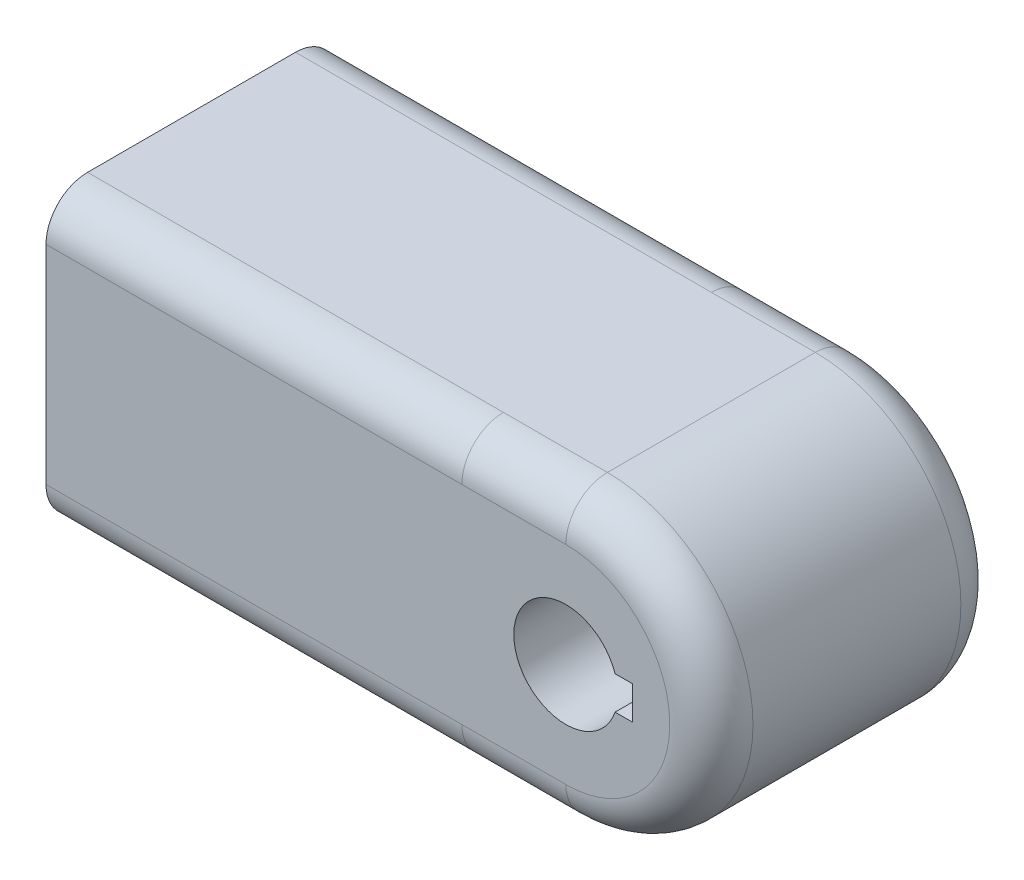
ISO-10303-21;
HEADER;
FILE_DESCRIPTION(('STEP AP214'),'2;1');
FILE_NAME('part.step','',(''),(''),'','','');
FILE_SCHEMA(('AUTOMOTIVE_DESIGN { 1 0 10303 214 1 1 1 1 }'));
ENDSEC;
DATA;
#1=APPLICATION_CONTEXT('core data for automotive mechanical design processes');
#2=APPLICATION_PROTOCOL_DEFINITION('international standard','automotive_design',2000,#1);
#3=PRODUCT_CONTEXT('',#1,'mechanical');
#4=PRODUCT('Part','Part','',(#3));
#5=PRODUCT_RELATED_PRODUCT_CATEGORY('part','',(#4));
#6=PRODUCT_DEFINITION_FORMATION('','',#4);
#7=PRODUCT_DEFINITION_CONTEXT('part definition',#1,'design');
#8=PRODUCT_DEFINITION('design','',#6,#7);
#9=PRODUCT_DEFINITION_SHAPE('','',#8);
#10=(LENGTH_UNIT() NAMED_UNIT(*) SI_UNIT(.MILLI.,.METRE.));
#11=(NAMED_UNIT(*) PLANE_ANGLE_UNIT() SI_UNIT($,.RADIAN.));
#12=(NAMED_UNIT(*) SI_UNIT($,.STERADIAN.) SOLID_ANGLE_UNIT());
#13=UNCERTAINTY_MEASURE_WITH_UNIT(LENGTH_MEASURE(1.E-05),#10,'distance_accuracy_value','');
#14=(GEOMETRIC_REPRESENTATION_CONTEXT(3) GLOBAL_UNCERTAINTY_ASSIGNED_CONTEXT((#13)) GLOBAL_UNIT_ASSIGNED_CONTEXT((#10,
#11,#12)) REPRESENTATION_CONTEXT('',''));
#15=CARTESIAN_POINT('',(0.,0.,0.));
#16=DIRECTION('',(0.,0.,1.));
#17=DIRECTION('',(1.,0.,0.));
#18=AXIS2_PLACEMENT_3D('',#15,#16,#17);
#19=CARTESIAN_POINT('',(125.,0.,35.));
#20=DIRECTION('',(0.,0.,1.));
#21=DIRECTION('',(1.,0.,0.));
#22=AXIS2_PLACEMENT_3D('',#19,#20,#21);
#23=CYLINDRICAL_SURFACE('',#22,35.);
#24=DIRECTION('',(0.,0.,1.));
#25=VECTOR('',#24,1.);
#26=CARTESIAN_POINT('',(125.,35.,24.9999999999999));
#27=LINE('',#26,#25);
#28=CARTESIAN_POINT('',(125.,35.,25.));
#29=VERTEX_POINT('',#28);
#30=CARTESIAN_POINT('',(125.,35.,-25.));
#31=VERTEX_POINT('',#30);
#32=EDGE_CURVE('E413',#29,#31,#27,.F.);
#33=ORIENTED_EDGE('',*,*,#32,.F.);
#34=CARTESIAN_POINT('',(125.,0.,25.));
#35=DIRECTION('',(0.,0.,-1.));
#36=DIRECTION('',(-1.,0.,0.));
#37=AXIS2_PLACEMENT_3D('',#34,#35,#36);
#38=CIRCLE('',#37,35.);
#39=CARTESIAN_POINT('',(125.,-35.,25.));
#40=VERTEX_POINT('',#39);
#41=EDGE_CURVE('E440',#29,#40,#38,.T.);
#42=ORIENTED_EDGE('',*,*,#41,.T.);
#43=DIRECTION('',(0.,0.,1.));
#44=VECTOR('',#43,1.);
#45=CARTESIAN_POINT('',(125.,-35.,24.9999999999999));
#46=LINE('',#45,#44);
#47=CARTESIAN_POINT('',(125.,-35.,-25.));
#48=VERTEX_POINT('',#47);
#49=EDGE_CURVE('E417',#48,#40,#46,.T.);
#50=ORIENTED_EDGE('',*,*,#49,.F.);
#51=CARTESIAN_POINT('',(125.,0.,-25.));
#52=DIRECTION('',(0.,0.,1.));
#53=DIRECTION('',(1.,0.,0.));
#54=AXIS2_PLACEMENT_3D('',#51,#52,#53);
#55=CIRCLE('',#54,35.);
#56=EDGE_CURVE('E437',#48,#31,#55,.T.);
#57=ORIENTED_EDGE('',*,*,#56,.T.);
#58=EDGE_LOOP('',(#33,#42,#50,#57));
#59=FACE_BOUND('',#58,.T.);
#60=ADVANCED_FACE('F41',(#59),#23,.T.);
#61=CARTESIAN_POINT('',(0.,-25.,-25.));
#62=DIRECTION('',(1.,0.,0.));
#63=DIRECTION('',(0.,0.,-1.));
#64=AXIS2_PLACEMENT_3D('',#61,#62,#63);
#65=PLANE('',#64);
#66=CARTESIAN_POINT('',(0.,-25.,-25.));
#67=DIRECTION('',(1.,0.,0.));
#68=DIRECTION('',(0.,0.,-1.));
#69=AXIS2_PLACEMENT_3D('',#66,#67,#68);
#70=CIRCLE('',#69,10.);
#71=CARTESIAN_POINT('',(0.,-35.,-24.9999999999999));
#72=VERTEX_POINT('',#71);
#73=CARTESIAN_POINT('',(0.,-24.9999999999999,-35.));
#74=VERTEX_POINT('',#73);
#75=EDGE_CURVE('E342',#72,#74,#70,.T.);
#76=ORIENTED_EDGE('',*,*,#75,.F.);
#77=DIRECTION('',(0.,0.,-1.));
#78=VECTOR('',#77,1.);
#79=CARTESIAN_POINT('',(0.,-35.,24.9999999999999));
#80=LINE('',#79,#78);
#81=CARTESIAN_POINT('',(0.,-35.,24.9999999999999));
#82=VERTEX_POINT('',#81);
#83=EDGE_CURVE('E347',#82,#72,#80,.T.);
#84=ORIENTED_EDGE('',*,*,#83,.F.);
#85=CARTESIAN_POINT('',(0.,-25.,25.));
#86=DIRECTION('',(1.,0.,0.));
#87=DIRECTION('',(0.,0.,1.));
#88=AXIS2_PLACEMENT_3D('',#85,#86,#87);
#89=CIRCLE('',#88,10.);
#90=CARTESIAN_POINT('',(0.,-25.,35.));
#91=VERTEX_POINT('',#90);
#92=EDGE_CURVE('E377',#91,#82,#89,.T.);
#93=ORIENTED_EDGE('',*,*,#92,.F.);
#94=DIRECTION('',(0.,-1.,0.));
#95=VECTOR('',#94,1.);
#96=CARTESIAN_POINT('',(0.,-24.9999999999999,35.));
#97=LINE('',#96,#95);
#98=CARTESIAN_POINT('',(0.,24.9999999999999,35.));
#99=VERTEX_POINT('',#98);
#100=EDGE_CURVE('E374',#99,#91,#97,.T.);
#101=ORIENTED_EDGE('',*,*,#100,.F.);
#102=CARTESIAN_POINT('',(0.,25.,25.));
#103=DIRECTION('',(1.,0.,0.));
#104=DIRECTION('',(0.,0.,1.));
#105=AXIS2_PLACEMENT_3D('',#102,#103,#104);
#106=CIRCLE('',#105,10.);
#107=CARTESIAN_POINT('',(0.,35.,24.9999999999999));
#108=VERTEX_POINT('',#107);
#109=EDGE_CURVE('E371',#108,#99,#106,.T.);
#110=ORIENTED_EDGE('',*,*,#109,.F.);
#111=DIRECTION('',(0.,0.,1.));
#112=VECTOR('',#111,1.);
#113=CARTESIAN_POINT('',(0.,35.,24.9999999999999));
#114=LINE('',#113,#112);
#115=CARTESIAN_POINT('',(0.,35.,-24.9999999999999));
#116=VERTEX_POINT('',#115);
#117=EDGE_CURVE('E368',#116,#108,#114,.T.);
#118=ORIENTED_EDGE('',*,*,#117,.F.);
#119=CARTESIAN_POINT('',(0.,25.,-25.));
#120=DIRECTION('',(1.,0.,0.));
#121=DIRECTION('',(0.,0.,1.));
#122=AXIS2_PLACEMENT_3D('',#119,#120,#121);
#123=CIRCLE('',#122,10.);
#124=CARTESIAN_POINT('',(0.,24.9999999999999,-35.));
#125=VERTEX_POINT('',#124);
#126=EDGE_CURVE('E365',#125,#116,#123,.T.);
#127=ORIENTED_EDGE('',*,*,#126,.F.);
#128=DIRECTION('',(0.,1.,0.));
#129=VECTOR('',#128,1.);
#130=CARTESIAN_POINT('',(0.,-24.9999999999999,-35.));
#131=LINE('',#130,#129);
#132=EDGE_CURVE('E362',#74,#125,#131,.T.);
#133=ORIENTED_EDGE('',*,*,#132,.F.);
#134=EDGE_LOOP('',(#76,#84,#93,#101,#110,#118,#127,#133));
#135=FACE_BOUND('',#134,.T.);
#136=CARTESIAN_POINT('',(0.,23.0958586209337,23.2382917131704));
#137=DIRECTION('',(1.,0.,0.));
#138=DIRECTION('',(0.,0.,-1.));
#139=AXIS2_PLACEMENT_3D('',#136,#137,#138);
#140=CIRCLE('',#139,6.76469125285392);
#141=CARTESIAN_POINT('',(0.,29.8605498737879,23.2382917131699));
#142=VERTEX_POINT('',#141);
#143=CARTESIAN_POINT('',(0.,23.0958586209337,30.0029829660241));
#144=VERTEX_POINT('',#143);
#145=EDGE_CURVE('E285',#142,#144,#140,.T.);
#146=ORIENTED_EDGE('',*,*,#145,.T.);
#147=DIRECTION('',(0.,-1.,0.));
#148=VECTOR('',#147,1.);
#149=CARTESIAN_POINT('',(0.,23.0958586209337,30.0029829660241));
#150=LINE('',#149,#148);
#151=CARTESIAN_POINT('',(0.,-23.3807248054077,30.0029829660241));
#152=VERTEX_POINT('',#151);
#153=EDGE_CURVE('E289',#144,#152,#150,.T.);
#154=ORIENTED_EDGE('',*,*,#153,.T.);
#155=CARTESIAN_POINT('',(0.,-23.3807248054077,23.2382917131704));
#156=DIRECTION('',(1.,0.,0.));
#157=DIRECTION('',(0.,0.,-1.));
#158=AXIS2_PLACEMENT_3D('',#155,#156,#157);
#159=CIRCLE('',#158,6.76469125285333);
#160=CARTESIAN_POINT('',(0.,-30.1454160582611,23.238291713171));
#161=VERTEX_POINT('',#160);
#162=EDGE_CURVE('E294',#152,#161,#159,.T.);
#163=ORIENTED_EDGE('',*,*,#162,.T.);
#164=DIRECTION('',(0.,0.,-1.));
#165=VECTOR('',#164,1.);
#166=CARTESIAN_POINT('',(0.,-30.1454160582608,23.238291713171));
#167=LINE('',#166,#165);
#168=CARTESIAN_POINT('',(0.,-30.1454160582611,-23.2382917131693));
#169=VERTEX_POINT('',#168);
#170=EDGE_CURVE('E298',#161,#169,#167,.T.);
#171=ORIENTED_EDGE('',*,*,#170,.T.);
#172=CARTESIAN_POINT('',(0.,-23.3807248054083,-23.2382917131693));
#173=DIRECTION('',(1.,0.,0.));
#174=DIRECTION('',(0.,0.,-1.));
#175=AXIS2_PLACEMENT_3D('',#172,#173,#174);
#176=CIRCLE('',#175,6.76469125285274);
#177=CARTESIAN_POINT('',(0.,-23.3807248054083,-30.002982966022));
#178=VERTEX_POINT('',#177);
#179=EDGE_CURVE('E302',#169,#178,#176,.T.);
#180=ORIENTED_EDGE('',*,*,#179,.T.);
#181=DIRECTION('',(0.,1.,0.));
#182=VECTOR('',#181,1.);
#183=CARTESIAN_POINT('',(0.,-23.3807248054083,-30.002982966022));
#184=LINE('',#183,#182);
#185=CARTESIAN_POINT('',(0.,23.0958586209334,-30.002982966022));
#186=VERTEX_POINT('',#185);
#187=EDGE_CURVE('E306',#178,#186,#184,.T.);
#188=ORIENTED_EDGE('',*,*,#187,.T.);
#189=CARTESIAN_POINT('',(0.,23.0958586209334,-23.2382917131678));
#190=DIRECTION('',(1.,0.,0.));
#191=DIRECTION('',(0.,0.,-1.));
#192=AXIS2_PLACEMENT_3D('',#189,#190,#191);
#193=CIRCLE('',#192,6.76469125285422);
#194=CARTESIAN_POINT('',(0.,29.8605498737877,-23.2382917131678));
#195=VERTEX_POINT('',#194);
#196=EDGE_CURVE('E310',#186,#195,#193,.T.);
#197=ORIENTED_EDGE('',*,*,#196,.T.);
#198=DIRECTION('',(0.,0.,1.));
#199=VECTOR('',#198,1.);
#200=CARTESIAN_POINT('',(0.,29.8605498737877,-23.2382917131678));
#201=LINE('',#200,#199);
#202=EDGE_CURVE('E256',#195,#142,#201,.T.);
#203=ORIENTED_EDGE('',*,*,#202,.T.);
#204=EDGE_LOOP('',(#146,#154,#163,#171,#180,#188,#197,#203));
#205=FACE_BOUND('',#204,.T.);
#206=ADVANCED_FACE('F488',(#135,#205),#65,.F.);
#207=CARTESIAN_POINT('',(100.,-25.,-25.));
#208=DIRECTION('',(-1.,0.,0.));
#209=DIRECTION('',(0.,0.,1.));
#210=AXIS2_PLACEMENT_3D('',#207,#208,#209);
#211=CYLINDRICAL_SURFACE('',#210,10.);
#212=ORIENTED_EDGE('',*,*,#75,.T.);
#213=DIRECTION('',(-1.,0.,0.));
#214=VECTOR('',#213,1.);
#215=CARTESIAN_POINT('',(100.,-24.9999999999999,-35.));
#216=LINE('',#215,#214);
#217=CARTESIAN_POINT('',(100.,-24.9999999999999,-35.));
#218=VERTEX_POINT('',#217);
#219=EDGE_CURVE('E409',#218,#74,#216,.T.);
#220=ORIENTED_EDGE('',*,*,#219,.F.);
#221=CARTESIAN_POINT('',(100.,-25.,-25.));
#222=DIRECTION('',(1.,0.,0.));
#223=DIRECTION('',(0.,0.,-1.));
#224=AXIS2_PLACEMENT_3D('',#221,#222,#223);
#225=CIRCLE('',#224,10.);
#226=CARTESIAN_POINT('',(100.,-35.,-24.9999999999999));
#227=VERTEX_POINT('',#226);
#228=EDGE_CURVE('E343',#227,#218,#225,.T.);
#229=ORIENTED_EDGE('',*,*,#228,.F.);
#230=DIRECTION('',(-1.,0.,0.));
#231=VECTOR('',#230,1.);
#232=CARTESIAN_POINT('',(100.,-35.,-24.9999999999999));
#233=LINE('',#232,#231);
#234=EDGE_CURVE('E358',#227,#72,#233,.T.);
#235=ORIENTED_EDGE('',*,*,#234,.T.);
#236=EDGE_LOOP('',(#212,#220,#229,#235));
#237=FACE_BOUND('',#236,.T.);
#238=ADVANCED_FACE('F522',(#237),#211,.T.);
#239=CARTESIAN_POINT('',(100.,-24.9999999999999,-35.));
#240=DIRECTION('',(0.,0.,1.));
#241=DIRECTION('',(1.,0.,0.));
#242=AXIS2_PLACEMENT_3D('',#239,#240,#241);
#243=PLANE('',#242);
#244=DIRECTION('',(1.,0.,0.));
#245=VECTOR('',#244,1.);
#246=CARTESIAN_POINT('',(0.,4.00000000000001,-35.));
#247=LINE('',#246,#245);
#248=CARTESIAN_POINT('',(136.842719282327,4.,-35.));
#249=VERTEX_POINT('',#248);
#250=CARTESIAN_POINT('',(141.,4.,-35.));
#251=VERTEX_POINT('',#250);
#252=EDGE_CURVE('E236',#249,#251,#247,.T.);
#253=ORIENTED_EDGE('',*,*,#252,.F.);
#254=CARTESIAN_POINT('',(125.,0.,-35.));
#255=DIRECTION('',(0.,0.,-1.));
#256=DIRECTION('',(-1.,0.,0.));
#257=AXIS2_PLACEMENT_3D('',#254,#255,#256);
#258=CIRCLE('',#257,12.5);
#259=CARTESIAN_POINT('',(136.842719282327,-4.,-35.));
#260=VERTEX_POINT('',#259);
#261=EDGE_CURVE('E59',#260,#249,#258,.T.);
#262=ORIENTED_EDGE('',*,*,#261,.F.);
#263=DIRECTION('',(1.,0.,0.));
#264=VECTOR('',#263,1.);
#265=CARTESIAN_POINT('',(0.,-3.99999999999999,-35.));
#266=LINE('',#265,#264);
#267=CARTESIAN_POINT('',(141.,-4.,-35.));
#268=VERTEX_POINT('',#267);
#269=EDGE_CURVE('E223',#260,#268,#266,.T.);
#270=ORIENTED_EDGE('',*,*,#269,.T.);
#271=DIRECTION('',(0.,1.,0.));
#272=VECTOR('',#271,1.);
#273=CARTESIAN_POINT('',(141.,0.,-35.));
#274=LINE('',#273,#272);
#275=EDGE_CURVE('E227',#268,#251,#274,.T.);
#276=ORIENTED_EDGE('',*,*,#275,.T.);
#277=EDGE_LOOP('',(#253,#262,#270,#276));
#278=FACE_BOUND('',#277,.T.);
#279=CARTESIAN_POINT('',(125.,0.,-35.));
#280=DIRECTION('',(0.,0.,1.));
#281=DIRECTION('',(1.,0.,0.));
#282=AXIS2_PLACEMENT_3D('',#279,#280,#281);
#283=CIRCLE('',#282,25.);
#284=CARTESIAN_POINT('',(125.,25.,-35.));
#285=VERTEX_POINT('',#284);
#286=CARTESIAN_POINT('',(125.,-25.,-35.));
#287=VERTEX_POINT('',#286);
#288=EDGE_CURVE('E446',#285,#287,#283,.F.);
#289=ORIENTED_EDGE('',*,*,#288,.T.);
#290=DIRECTION('',(-1.,0.,0.));
#291=VECTOR('',#290,1.);
#292=CARTESIAN_POINT('',(100.,-24.9999999999999,-35.));
#293=LINE('',#292,#291);
#294=EDGE_CURVE('E449',#287,#218,#293,.T.);
#295=ORIENTED_EDGE('',*,*,#294,.T.);
#296=ORIENTED_EDGE('',*,*,#219,.T.);
#297=ORIENTED_EDGE('',*,*,#132,.T.);
#298=DIRECTION('',(-1.,0.,0.));
#299=VECTOR('',#298,1.);
#300=CARTESIAN_POINT('',(100.,24.9999999999999,-35.));
#301=LINE('',#300,#299);
#302=CARTESIAN_POINT('',(100.,24.9999999999999,-35.));
#303=VERTEX_POINT('',#302);
#304=EDGE_CURVE('E405',#303,#125,#301,.T.);
#305=ORIENTED_EDGE('',*,*,#304,.F.);
#306=DIRECTION('',(-1.,0.,0.));
#307=VECTOR('',#306,1.);
#308=CARTESIAN_POINT('',(100.,25.,-35.));
#309=LINE('',#308,#307);
#310=EDGE_CURVE('E443',#303,#285,#309,.F.);
#311=ORIENTED_EDGE('',*,*,#310,.T.);
#312=EDGE_LOOP('',(#289,#295,#296,#297,#305,#311));
#313=FACE_BOUND('',#312,.T.);
#314=ADVANCED_FACE('F603',(#278,#313),#243,.F.);
#315=CARTESIAN_POINT('',(100.,25.,-25.));
#316=DIRECTION('',(-1.,0.,0.));
#317=DIRECTION('',(0.,0.,1.));
#318=AXIS2_PLACEMENT_3D('',#315,#316,#317);
#319=CYLINDRICAL_SURFACE('',#318,10.);
#320=ORIENTED_EDGE('',*,*,#126,.T.);
#321=DIRECTION('',(-1.,0.,0.));
#322=VECTOR('',#321,1.);
#323=CARTESIAN_POINT('',(100.,35.,-24.9999999999999));
#324=LINE('',#323,#322);
#325=CARTESIAN_POINT('',(100.,35.,-24.9999999999999));
#326=VERTEX_POINT('',#325);
#327=EDGE_CURVE('E401',#326,#116,#324,.T.);
#328=ORIENTED_EDGE('',*,*,#327,.F.);
#329=CARTESIAN_POINT('',(100.,25.,-25.));
#330=DIRECTION('',(1.,0.,0.));
#331=DIRECTION('',(0.,0.,1.));
#332=AXIS2_PLACEMENT_3D('',#329,#330,#331);
#333=CIRCLE('',#332,10.);
#334=EDGE_CURVE('E346',#303,#326,#333,.T.);
#335=ORIENTED_EDGE('',*,*,#334,.F.);
#336=ORIENTED_EDGE('',*,*,#304,.T.);
#337=EDGE_LOOP('',(#320,#328,#335,#336));
#338=FACE_BOUND('',#337,.T.);
#339=ADVANCED_FACE('F484',(#338),#319,.T.);
#340=CARTESIAN_POINT('',(100.,35.,24.9999999999999));
#341=DIRECTION('',(0.,-1.,0.));
#342=DIRECTION('',(0.,0.,-1.));
#343=AXIS2_PLACEMENT_3D('',#340,#341,#342);
#344=PLANE('',#343);
#345=DIRECTION('',(-1.,0.,0.));
#346=VECTOR('',#345,1.);
#347=CARTESIAN_POINT('',(100.,35.,24.9999999999999));
#348=LINE('',#347,#346);
#349=CARTESIAN_POINT('',(100.,35.,24.9999999999999));
#350=VERTEX_POINT('',#349);
#351=EDGE_CURVE('E397',#350,#108,#348,.T.);
#352=ORIENTED_EDGE('',*,*,#351,.F.);
#353=DIRECTION('',(-1.,0.,0.));
#354=VECTOR('',#353,1.);
#355=CARTESIAN_POINT('',(100.,35.,24.9999999999999));
#356=LINE('',#355,#354);
#357=EDGE_CURVE('E11',#350,#29,#356,.F.);
#358=ORIENTED_EDGE('',*,*,#357,.T.);
#359=ORIENTED_EDGE('',*,*,#32,.T.);
#360=DIRECTION('',(-1.,0.,0.));
#361=VECTOR('',#360,1.);
#362=CARTESIAN_POINT('',(100.,35.,-25.));
#363=LINE('',#362,#361);
#364=EDGE_CURVE('E51',#31,#326,#363,.T.);
#365=ORIENTED_EDGE('',*,*,#364,.T.);
#366=ORIENTED_EDGE('',*,*,#327,.T.);
#367=ORIENTED_EDGE('',*,*,#117,.T.);
#368=EDGE_LOOP('',(#352,#358,#359,#365,#366,#367));
#369=FACE_BOUND('',#368,.T.);
#370=ADVANCED_FACE('F480',(#369),#344,.F.);
#371=CARTESIAN_POINT('',(100.,25.,25.));
#372=DIRECTION('',(-1.,0.,0.));
#373=DIRECTION('',(0.,0.,1.));
#374=AXIS2_PLACEMENT_3D('',#371,#372,#373);
#375=CYLINDRICAL_SURFACE('',#374,10.);
#376=ORIENTED_EDGE('',*,*,#109,.T.);
#377=DIRECTION('',(-1.,0.,0.));
#378=VECTOR('',#377,1.);
#379=CARTESIAN_POINT('',(100.,24.9999999999999,35.));
#380=LINE('',#379,#378);
#381=CARTESIAN_POINT('',(100.,24.9999999999999,35.));
#382=VERTEX_POINT('',#381);
#383=EDGE_CURVE('E393',#382,#99,#380,.T.);
#384=ORIENTED_EDGE('',*,*,#383,.F.);
#385=CARTESIAN_POINT('',(100.,25.,25.));
#386=DIRECTION('',(1.,0.,0.));
#387=DIRECTION('',(0.,0.,1.));
#388=AXIS2_PLACEMENT_3D('',#385,#386,#387);
#389=CIRCLE('',#388,10.);
#390=EDGE_CURVE('E351',#350,#382,#389,.T.);
#391=ORIENTED_EDGE('',*,*,#390,.F.);
#392=ORIENTED_EDGE('',*,*,#351,.T.);
#393=EDGE_LOOP('',(#376,#384,#391,#392));
#394=FACE_BOUND('',#393,.T.);
#395=ADVANCED_FACE('F494',(#394),#375,.T.);
#396=CARTESIAN_POINT('',(100.,-24.9999999999999,35.));
#397=DIRECTION('',(0.,0.,-1.));
#398=DIRECTION('',(-1.,0.,0.));
#399=AXIS2_PLACEMENT_3D('',#396,#397,#398);
#400=PLANE('',#399);
#401=DIRECTION('',(1.,0.,0.));
#402=VECTOR('',#401,1.);
#403=CARTESIAN_POINT('',(0.,-3.99999999999999,35.));
#404=LINE('',#403,#402);
#405=CARTESIAN_POINT('',(136.842719282327,-4.,35.));
#406=VERTEX_POINT('',#405);
#407=CARTESIAN_POINT('',(141.,-4.,35.));
#408=VERTEX_POINT('',#407);
#409=EDGE_CURVE('E210',#406,#408,#404,.T.);
#410=ORIENTED_EDGE('',*,*,#409,.F.);
#411=CARTESIAN_POINT('',(125.,0.,35.));
#412=DIRECTION('',(0.,0.,-1.));
#413=DIRECTION('',(-1.,0.,0.));
#414=AXIS2_PLACEMENT_3D('',#411,#412,#413);
#415=CIRCLE('',#414,12.5);
#416=CARTESIAN_POINT('',(136.842719282327,4.,35.));
#417=VERTEX_POINT('',#416);
#418=EDGE_CURVE('E206',#406,#417,#415,.T.);
#419=ORIENTED_EDGE('',*,*,#418,.T.);
#420=DIRECTION('',(1.,0.,0.));
#421=VECTOR('',#420,1.);
#422=CARTESIAN_POINT('',(0.,4.00000000000001,35.));
#423=LINE('',#422,#421);
#424=CARTESIAN_POINT('',(141.,3.99999999999999,35.));
#425=VERTEX_POINT('',#424);
#426=EDGE_CURVE('E213',#417,#425,#423,.T.);
#427=ORIENTED_EDGE('',*,*,#426,.T.);
#428=DIRECTION('',(0.,1.,0.));
#429=VECTOR('',#428,1.);
#430=CARTESIAN_POINT('',(141.,0.,35.));
#431=LINE('',#430,#429);
#432=EDGE_CURVE('E218',#408,#425,#431,.T.);
#433=ORIENTED_EDGE('',*,*,#432,.F.);
#434=EDGE_LOOP('',(#410,#419,#427,#433));
#435=FACE_BOUND('',#434,.T.);
#436=DIRECTION('',(-1.,0.,0.));
#437=VECTOR('',#436,1.);
#438=CARTESIAN_POINT('',(100.,-25.,35.));
#439=LINE('',#438,#437);
#440=CARTESIAN_POINT('',(100.,-25.,35.));
#441=VERTEX_POINT('',#440);
#442=EDGE_CURVE('E389',#441,#91,#439,.T.);
#443=ORIENTED_EDGE('',*,*,#442,.F.);
#444=DIRECTION('',(-1.,0.,0.));
#445=VECTOR('',#444,1.);
#446=CARTESIAN_POINT('',(100.,-24.9999999999999,35.));
#447=LINE('',#446,#445);
#448=CARTESIAN_POINT('',(125.,-25.,35.));
#449=VERTEX_POINT('',#448);
#450=EDGE_CURVE('E434',#441,#449,#447,.F.);
#451=ORIENTED_EDGE('',*,*,#450,.T.);
#452=CARTESIAN_POINT('',(125.,0.,35.));
#453=DIRECTION('',(0.,0.,-1.));
#454=DIRECTION('',(-1.,0.,0.));
#455=AXIS2_PLACEMENT_3D('',#452,#453,#454);
#456=CIRCLE('',#455,25.);
#457=CARTESIAN_POINT('',(125.,25.,35.));
#458=VERTEX_POINT('',#457);
#459=EDGE_CURVE('E431',#449,#458,#456,.F.);
#460=ORIENTED_EDGE('',*,*,#459,.T.);
#461=DIRECTION('',(-1.,0.,0.));
#462=VECTOR('',#461,1.);
#463=CARTESIAN_POINT('',(100.,25.,35.));
#464=LINE('',#463,#462);
#465=EDGE_CURVE('E428',#458,#382,#464,.T.);
#466=ORIENTED_EDGE('',*,*,#465,.T.);
#467=ORIENTED_EDGE('',*,*,#383,.T.);
#468=ORIENTED_EDGE('',*,*,#100,.T.);
#469=EDGE_LOOP('',(#443,#451,#460,#466,#467,#468));
#470=FACE_BOUND('',#469,.T.);
#471=ADVANCED_FACE('F220',(#435,#470),#400,.F.);
#472=CARTESIAN_POINT('',(100.,-25.,25.));
#473=DIRECTION('',(-1.,0.,0.));
#474=DIRECTION('',(0.,0.,1.));
#475=AXIS2_PLACEMENT_3D('',#472,#473,#474);
#476=CYLINDRICAL_SURFACE('',#475,10.);
#477=ORIENTED_EDGE('',*,*,#92,.T.);
#478=DIRECTION('',(-1.,0.,0.));
#479=VECTOR('',#478,1.);
#480=CARTESIAN_POINT('',(100.,-35.,24.9999999999999));
#481=LINE('',#480,#479);
#482=CARTESIAN_POINT('',(100.,-35.,25.));
#483=VERTEX_POINT('',#482);
#484=EDGE_CURVE('E385',#483,#82,#481,.T.);
#485=ORIENTED_EDGE('',*,*,#484,.F.);
#486=CARTESIAN_POINT('',(100.,-25.,25.));
#487=DIRECTION('',(1.,0.,0.));
#488=DIRECTION('',(0.,0.,1.));
#489=AXIS2_PLACEMENT_3D('',#486,#487,#488);
#490=CIRCLE('',#489,10.);
#491=EDGE_CURVE('E355',#441,#483,#490,.T.);
#492=ORIENTED_EDGE('',*,*,#491,.F.);
#493=ORIENTED_EDGE('',*,*,#442,.T.);
#494=EDGE_LOOP('',(#477,#485,#492,#493));
#495=FACE_BOUND('',#494,.T.);
#496=ADVANCED_FACE('F517',(#495),#476,.T.);
#497=CARTESIAN_POINT('',(100.,-35.,24.9999999999999));
#498=DIRECTION('',(0.,1.,0.));
#499=DIRECTION('',(0.,0.,1.));
#500=AXIS2_PLACEMENT_3D('',#497,#498,#499);
#501=PLANE('',#500);
#502=ORIENTED_EDGE('',*,*,#49,.T.);
#503=DIRECTION('',(-1.,0.,0.));
#504=VECTOR('',#503,1.);
#505=CARTESIAN_POINT('',(100.,-35.,24.9999999999999));
#506=LINE('',#505,#504);
#507=EDGE_CURVE('E424',#40,#483,#506,.T.);
#508=ORIENTED_EDGE('',*,*,#507,.T.);
#509=ORIENTED_EDGE('',*,*,#484,.T.);
#510=ORIENTED_EDGE('',*,*,#83,.T.);
#511=ORIENTED_EDGE('',*,*,#234,.F.);
#512=DIRECTION('',(-1.,0.,0.));
#513=VECTOR('',#512,1.);
#514=CARTESIAN_POINT('',(100.,-35.,-25.));
#515=LINE('',#514,#513);
#516=EDGE_CURVE('E421',#227,#48,#515,.F.);
#517=ORIENTED_EDGE('',*,*,#516,.T.);
#518=EDGE_LOOP('',(#502,#508,#509,#510,#511,#517));
#519=FACE_BOUND('',#518,.T.);
#520=ADVANCED_FACE('F506',(#519),#501,.F.);
#521=CARTESIAN_POINT('',(100.,23.0958586209337,23.2382917131704));
#522=DIRECTION('',(-1.,0.,0.));
#523=DIRECTION('',(0.,0.,1.));
#524=AXIS2_PLACEMENT_3D('',#521,#522,#523);
#525=CYLINDRICAL_SURFACE('',#524,6.76469125285392);
#526=ORIENTED_EDGE('',*,*,#145,.F.);
#527=DIRECTION('',(-1.,0.,0.));
#528=VECTOR('',#527,1.);
#529=CARTESIAN_POINT('',(100.,29.8605498737879,23.2382917131699));
#530=LINE('',#529,#528);
#531=CARTESIAN_POINT('',(100.,29.8605498737879,23.2382917131699));
#532=VERTEX_POINT('',#531);
#533=EDGE_CURVE('E284',#532,#142,#530,.T.);
#534=ORIENTED_EDGE('',*,*,#533,.F.);
#535=CARTESIAN_POINT('',(100.,23.0958586209337,23.2382917131704));
#536=DIRECTION('',(1.,0.,0.));
#537=DIRECTION('',(0.,0.,-1.));
#538=AXIS2_PLACEMENT_3D('',#535,#536,#537);
#539=CIRCLE('',#538,6.76469125285392);
#540=CARTESIAN_POINT('',(100.,23.0958586209337,30.0029829660241));
#541=VERTEX_POINT('',#540);
#542=EDGE_CURVE('E251',#532,#541,#539,.T.);
#543=ORIENTED_EDGE('',*,*,#542,.T.);
#544=DIRECTION('',(-1.,0.,0.));
#545=VECTOR('',#544,1.);
#546=CARTESIAN_POINT('',(100.,23.0958586209337,30.0029829660241));
#547=LINE('',#546,#545);
#548=EDGE_CURVE('E338',#541,#144,#547,.T.);
#549=ORIENTED_EDGE('',*,*,#548,.T.);
#550=EDGE_LOOP('',(#526,#534,#543,#549));
#551=FACE_BOUND('',#550,.T.);
#552=ADVANCED_FACE('F587',(#551),#525,.F.);
#553=CARTESIAN_POINT('',(100.,23.0958586209337,30.0029829660241));
#554=DIRECTION('',(0.,0.,-1.));
#555=DIRECTION('',(0.,1.,0.));
#556=AXIS2_PLACEMENT_3D('',#553,#554,#555);
#557=PLANE('',#556);
#558=ORIENTED_EDGE('',*,*,#153,.F.);
#559=ORIENTED_EDGE('',*,*,#548,.F.);
#560=DIRECTION('',(0.,-1.,0.));
#561=VECTOR('',#560,1.);
#562=CARTESIAN_POINT('',(100.,23.0958586209337,30.0029829660241));
#563=LINE('',#562,#561);
#564=CARTESIAN_POINT('',(100.,-23.3807248054077,30.0029829660241));
#565=VERTEX_POINT('',#564);
#566=EDGE_CURVE('E255',#541,#565,#563,.T.);
#567=ORIENTED_EDGE('',*,*,#566,.T.);
#568=DIRECTION('',(-1.,0.,0.));
#569=VECTOR('',#568,1.);
#570=CARTESIAN_POINT('',(100.,-23.3807248054077,30.0029829660241));
#571=LINE('',#570,#569);
#572=EDGE_CURVE('E335',#565,#152,#571,.T.);
#573=ORIENTED_EDGE('',*,*,#572,.T.);
#574=EDGE_LOOP('',(#558,#559,#567,#573));
#575=FACE_BOUND('',#574,.T.);
#576=ADVANCED_FACE('F583',(#575),#557,.T.);
#577=CARTESIAN_POINT('',(100.,-23.3807248054077,23.2382917131704));
#578=DIRECTION('',(-1.,0.,0.));
#579=DIRECTION('',(0.,0.,1.));
#580=AXIS2_PLACEMENT_3D('',#577,#578,#579);
#581=CYLINDRICAL_SURFACE('',#580,6.76469125285333);
#582=ORIENTED_EDGE('',*,*,#162,.F.);
#583=ORIENTED_EDGE('',*,*,#572,.F.);
#584=CARTESIAN_POINT('',(100.,-23.3807248054077,23.2382917131704));
#585=DIRECTION('',(1.,0.,0.));
#586=DIRECTION('',(0.,0.,-1.));
#587=AXIS2_PLACEMENT_3D('',#584,#585,#586);
#588=CIRCLE('',#587,6.76469125285333);
#589=CARTESIAN_POINT('',(100.,-30.1454160582611,23.238291713171));
#590=VERTEX_POINT('',#589);
#591=EDGE_CURVE('E260',#565,#590,#588,.T.);
#592=ORIENTED_EDGE('',*,*,#591,.T.);
#593=DIRECTION('',(-1.,0.,0.));
#594=VECTOR('',#593,1.);
#595=CARTESIAN_POINT('',(100.,-30.1454160582611,23.238291713171));
#596=LINE('',#595,#594);
#597=EDGE_CURVE('E332',#590,#161,#596,.T.);
#598=ORIENTED_EDGE('',*,*,#597,.T.);
#599=EDGE_LOOP('',(#582,#583,#592,#598));
#600=FACE_BOUND('',#599,.T.);
#601=ADVANCED_FACE('F579',(#600),#581,.F.);
#602=CARTESIAN_POINT('',(100.,-30.1454160582608,23.238291713171));
#603=DIRECTION('',(0.,1.,0.));
#604=DIRECTION('',(0.,0.,1.));
#605=AXIS2_PLACEMENT_3D('',#602,#603,#604);
#606=PLANE('',#605);
#607=ORIENTED_EDGE('',*,*,#170,.F.);
#608=ORIENTED_EDGE('',*,*,#597,.F.);
#609=DIRECTION('',(0.,0.,-1.));
#610=VECTOR('',#609,1.);
#611=CARTESIAN_POINT('',(100.,-30.1454160582608,23.238291713171));
#612=LINE('',#611,#610);
#613=CARTESIAN_POINT('',(100.,-30.1454160582611,-23.2382917131693));
#614=VERTEX_POINT('',#613);
#615=EDGE_CURVE('E264',#590,#614,#612,.T.);
#616=ORIENTED_EDGE('',*,*,#615,.T.);
#617=DIRECTION('',(-1.,0.,0.));
#618=VECTOR('',#617,1.);
#619=CARTESIAN_POINT('',(100.,-30.1454160582611,-23.2382917131693));
#620=LINE('',#619,#618);
#621=EDGE_CURVE('E329',#614,#169,#620,.T.);
#622=ORIENTED_EDGE('',*,*,#621,.T.);
#623=EDGE_LOOP('',(#607,#608,#616,#622));
#624=FACE_BOUND('',#623,.T.);
#625=ADVANCED_FACE('F575',(#624),#606,.T.);
#626=CARTESIAN_POINT('',(100.,-23.3807248054083,-23.2382917131693));
#627=DIRECTION('',(-1.,0.,0.));
#628=DIRECTION('',(0.,0.,1.));
#629=AXIS2_PLACEMENT_3D('',#626,#627,#628);
#630=CYLINDRICAL_SURFACE('',#629,6.76469125285274);
#631=ORIENTED_EDGE('',*,*,#179,.F.);
#632=ORIENTED_EDGE('',*,*,#621,.F.);
#633=CARTESIAN_POINT('',(100.,-23.3807248054083,-23.2382917131693));
#634=DIRECTION('',(1.,0.,0.));
#635=DIRECTION('',(0.,0.,-1.));
#636=AXIS2_PLACEMENT_3D('',#633,#634,#635);
#637=CIRCLE('',#636,6.76469125285274);
#638=CARTESIAN_POINT('',(100.,-23.3807248054083,-30.002982966022));
#639=VERTEX_POINT('',#638);
#640=EDGE_CURVE('E268',#614,#639,#637,.T.);
#641=ORIENTED_EDGE('',*,*,#640,.T.);
#642=DIRECTION('',(-1.,0.,0.));
#643=VECTOR('',#642,1.);
#644=CARTESIAN_POINT('',(100.,-23.3807248054083,-30.002982966022));
#645=LINE('',#644,#643);
#646=EDGE_CURVE('E326',#639,#178,#645,.T.);
#647=ORIENTED_EDGE('',*,*,#646,.T.);
#648=EDGE_LOOP('',(#631,#632,#641,#647));
#649=FACE_BOUND('',#648,.T.);
#650=ADVANCED_FACE('F571',(#649),#630,.F.);
#651=CARTESIAN_POINT('',(100.,-23.3807248054083,-30.002982966022));
#652=DIRECTION('',(0.,0.,1.));
#653=DIRECTION('',(1.,0.,0.));
#654=AXIS2_PLACEMENT_3D('',#651,#652,#653);
#655=PLANE('',#654);
#656=ORIENTED_EDGE('',*,*,#187,.F.);
#657=ORIENTED_EDGE('',*,*,#646,.F.);
#658=DIRECTION('',(0.,1.,0.));
#659=VECTOR('',#658,1.);
#660=CARTESIAN_POINT('',(100.,-23.3807248054083,-30.002982966022));
#661=LINE('',#660,#659);
#662=CARTESIAN_POINT('',(100.,23.0958586209334,-30.002982966022));
#663=VERTEX_POINT('',#662);
#664=EDGE_CURVE('E272',#639,#663,#661,.T.);
#665=ORIENTED_EDGE('',*,*,#664,.T.);
#666=DIRECTION('',(-1.,0.,0.));
#667=VECTOR('',#666,1.);
#668=CARTESIAN_POINT('',(100.,23.0958586209334,-30.002982966022));
#669=LINE('',#668,#667);
#670=EDGE_CURVE('E323',#663,#186,#669,.T.);
#671=ORIENTED_EDGE('',*,*,#670,.T.);
#672=EDGE_LOOP('',(#656,#657,#665,#671));
#673=FACE_BOUND('',#672,.T.);
#674=ADVANCED_FACE('F567',(#673),#655,.T.);
#675=CARTESIAN_POINT('',(100.,23.0958586209334,-23.2382917131678));
#676=DIRECTION('',(-1.,0.,0.));
#677=DIRECTION('',(0.,0.,1.));
#678=AXIS2_PLACEMENT_3D('',#675,#676,#677);
#679=CYLINDRICAL_SURFACE('',#678,6.76469125285422);
#680=ORIENTED_EDGE('',*,*,#196,.F.);
#681=ORIENTED_EDGE('',*,*,#670,.F.);
#682=CARTESIAN_POINT('',(100.,23.0958586209334,-23.2382917131678));
#683=DIRECTION('',(1.,0.,0.));
#684=DIRECTION('',(0.,0.,-1.));
#685=AXIS2_PLACEMENT_3D('',#682,#683,#684);
#686=CIRCLE('',#685,6.76469125285422);
#687=CARTESIAN_POINT('',(100.,29.8605498737877,-23.2382917131678));
#688=VERTEX_POINT('',#687);
#689=EDGE_CURVE('E276',#663,#688,#686,.T.);
#690=ORIENTED_EDGE('',*,*,#689,.T.);
#691=DIRECTION('',(-1.,0.,0.));
#692=VECTOR('',#691,1.);
#693=CARTESIAN_POINT('',(100.,29.8605498737877,-23.2382917131678));
#694=LINE('',#693,#692);
#695=EDGE_CURVE('E320',#688,#195,#694,.T.);
#696=ORIENTED_EDGE('',*,*,#695,.T.);
#697=EDGE_LOOP('',(#680,#681,#690,#696));
#698=FACE_BOUND('',#697,.T.);
#699=ADVANCED_FACE('F560',(#698),#679,.F.);
#700=CARTESIAN_POINT('',(100.,29.8605498737877,-23.2382917131678));
#701=DIRECTION('',(0.,-1.,0.));
#702=DIRECTION('',(0.,0.,-1.));
#703=AXIS2_PLACEMENT_3D('',#700,#701,#702);
#704=PLANE('',#703);
#705=ORIENTED_EDGE('',*,*,#202,.F.);
#706=ORIENTED_EDGE('',*,*,#695,.F.);
#707=DIRECTION('',(0.,0.,1.));
#708=VECTOR('',#707,1.);
#709=CARTESIAN_POINT('',(100.,29.8605498737877,-23.2382917131678));
#710=LINE('',#709,#708);
#711=EDGE_CURVE('E280',#688,#532,#710,.T.);
#712=ORIENTED_EDGE('',*,*,#711,.T.);
#713=ORIENTED_EDGE('',*,*,#533,.T.);
#714=EDGE_LOOP('',(#705,#706,#712,#713));
#715=FACE_BOUND('',#714,.T.);
#716=ADVANCED_FACE('F554',(#715),#704,.T.);
#717=CARTESIAN_POINT('',(100.,0.,0.));
#718=DIRECTION('',(-1.,0.,0.));
#719=DIRECTION('',(0.,0.,1.));
#720=AXIS2_PLACEMENT_3D('',#717,#718,#719);
#721=PLANE('',#720);
#722=ORIENTED_EDGE('',*,*,#566,.F.);
#723=ORIENTED_EDGE('',*,*,#542,.F.);
#724=ORIENTED_EDGE('',*,*,#711,.F.);
#725=ORIENTED_EDGE('',*,*,#689,.F.);
#726=ORIENTED_EDGE('',*,*,#664,.F.);
#727=ORIENTED_EDGE('',*,*,#640,.F.);
#728=ORIENTED_EDGE('',*,*,#615,.F.);
#729=ORIENTED_EDGE('',*,*,#591,.F.);
#730=EDGE_LOOP('',(#722,#723,#724,#725,#726,#727,#728,#729));
#731=FACE_BOUND('',#730,.T.);
#732=ADVANCED_FACE('F550',(#731),#721,.T.);
#733=CARTESIAN_POINT('',(100.,25.,25.));
#734=DIRECTION('',(-1.,0.,0.));
#735=DIRECTION('',(0.,0.,1.));
#736=AXIS2_PLACEMENT_3D('',#733,#734,#735);
#737=CYLINDRICAL_SURFACE('',#736,10.);
#738=ORIENTED_EDGE('',*,*,#390,.T.);
#739=ORIENTED_EDGE('',*,*,#465,.F.);
#740=CARTESIAN_POINT('',(125.,25.,25.));
#741=DIRECTION('',(1.,0.,0.));
#742=DIRECTION('',(0.,0.,-1.));
#743=AXIS2_PLACEMENT_3D('',#740,#741,#742);
#744=CIRCLE('',#743,10.);
#745=EDGE_CURVE('E290',#29,#458,#744,.T.);
#746=ORIENTED_EDGE('',*,*,#745,.F.);
#747=ORIENTED_EDGE('',*,*,#357,.F.);
#748=EDGE_LOOP('',(#738,#739,#746,#747));
#749=FACE_BOUND('',#748,.T.);
#750=ADVANCED_FACE('F500',(#749),#737,.T.);
#751=CARTESIAN_POINT('',(125.,0.,25.));
#752=DIRECTION('',(0.,0.,-1.));
#753=DIRECTION('',(-1.,0.,0.));
#754=AXIS2_PLACEMENT_3D('',#751,#752,#753);
#755=TOROIDAL_SURFACE('',#754,25.,10.);
#756=ORIENTED_EDGE('',*,*,#745,.T.);
#757=ORIENTED_EDGE('',*,*,#459,.F.);
#758=CARTESIAN_POINT('',(125.,-25.,25.));
#759=DIRECTION('',(-1.,0.,0.));
#760=DIRECTION('',(0.,0.,1.));
#761=AXIS2_PLACEMENT_3D('',#758,#759,#760);
#762=CIRCLE('',#761,10.);
#763=EDGE_CURVE('E455',#40,#449,#762,.T.);
#764=ORIENTED_EDGE('',*,*,#763,.F.);
#765=ORIENTED_EDGE('',*,*,#41,.F.);
#766=EDGE_LOOP('',(#756,#757,#764,#765));
#767=FACE_BOUND('',#766,.T.);
#768=ADVANCED_FACE('F511',(#767),#755,.T.);
#769=CARTESIAN_POINT('',(100.,-25.,24.9999999999999));
#770=DIRECTION('',(-1.,0.,0.));
#771=DIRECTION('',(0.,0.,1.));
#772=AXIS2_PLACEMENT_3D('',#769,#770,#771);
#773=CYLINDRICAL_SURFACE('',#772,10.);
#774=ORIENTED_EDGE('',*,*,#763,.T.);
#775=ORIENTED_EDGE('',*,*,#450,.F.);
#776=ORIENTED_EDGE('',*,*,#491,.T.);
#777=ORIENTED_EDGE('',*,*,#507,.F.);
#778=EDGE_LOOP('',(#774,#775,#776,#777));
#779=FACE_BOUND('',#778,.T.);
#780=ADVANCED_FACE('F514',(#779),#773,.T.);
#781=CARTESIAN_POINT('',(100.,25.,-25.));
#782=DIRECTION('',(-1.,0.,0.));
#783=DIRECTION('',(0.,0.,1.));
#784=AXIS2_PLACEMENT_3D('',#781,#782,#783);
#785=CYLINDRICAL_SURFACE('',#784,10.);
#786=ORIENTED_EDGE('',*,*,#334,.T.);
#787=ORIENTED_EDGE('',*,*,#364,.F.);
#788=CARTESIAN_POINT('',(125.,25.,-25.));
#789=DIRECTION('',(1.,0.,0.));
#790=DIRECTION('',(0.,0.,-1.));
#791=AXIS2_PLACEMENT_3D('',#788,#789,#790);
#792=CIRCLE('',#791,10.);
#793=EDGE_CURVE('E45',#285,#31,#792,.T.);
#794=ORIENTED_EDGE('',*,*,#793,.F.);
#795=ORIENTED_EDGE('',*,*,#310,.F.);
#796=EDGE_LOOP('',(#786,#787,#794,#795));
#797=FACE_BOUND('',#796,.T.);
#798=ADVANCED_FACE('F43',(#797),#785,.T.);
#799=CARTESIAN_POINT('',(125.,0.,-25.));
#800=DIRECTION('',(0.,0.,1.));
#801=DIRECTION('',(1.,0.,0.));
#802=AXIS2_PLACEMENT_3D('',#799,#800,#801);
#803=TOROIDAL_SURFACE('',#802,25.,10.);
#804=ORIENTED_EDGE('',*,*,#793,.T.);
#805=ORIENTED_EDGE('',*,*,#56,.F.);
#806=CARTESIAN_POINT('',(125.,-25.,-25.));
#807=DIRECTION('',(-1.,0.,0.));
#808=DIRECTION('',(0.,0.,1.));
#809=AXIS2_PLACEMENT_3D('',#806,#807,#808);
#810=CIRCLE('',#809,10.);
#811=EDGE_CURVE('E245',#287,#48,#810,.T.);
#812=ORIENTED_EDGE('',*,*,#811,.F.);
#813=ORIENTED_EDGE('',*,*,#288,.F.);
#814=EDGE_LOOP('',(#804,#805,#812,#813));
#815=FACE_BOUND('',#814,.T.);
#816=ADVANCED_FACE('F473',(#815),#803,.T.);
#817=CARTESIAN_POINT('',(100.,-24.9999999999999,-25.));
#818=DIRECTION('',(-1.,0.,0.));
#819=DIRECTION('',(0.,0.,1.));
#820=AXIS2_PLACEMENT_3D('',#817,#818,#819);
#821=CYLINDRICAL_SURFACE('',#820,10.);
#822=ORIENTED_EDGE('',*,*,#811,.T.);
#823=ORIENTED_EDGE('',*,*,#516,.F.);
#824=ORIENTED_EDGE('',*,*,#228,.T.);
#825=ORIENTED_EDGE('',*,*,#294,.F.);
#826=EDGE_LOOP('',(#822,#823,#824,#825));
#827=FACE_BOUND('',#826,.T.);
#828=ADVANCED_FACE('F524',(#827),#821,.T.);
#829=CARTESIAN_POINT('',(125.,0.,35.));
#830=DIRECTION('',(0.,0.,-1.));
#831=DIRECTION('',(-1.,0.,0.));
#832=AXIS2_PLACEMENT_3D('',#829,#830,#831);
#833=CYLINDRICAL_SURFACE('',#832,12.5);
#834=ORIENTED_EDGE('',*,*,#261,.T.);
#835=DIRECTION('',(0.,0.,-1.));
#836=VECTOR('',#835,1.);
#837=CARTESIAN_POINT('',(136.842719282327,4.,35.));
#838=LINE('',#837,#836);
#839=EDGE_CURVE('E203',#417,#249,#838,.T.);
#840=ORIENTED_EDGE('',*,*,#839,.F.);
#841=ORIENTED_EDGE('',*,*,#418,.F.);
#842=DIRECTION('',(0.,0.,-1.));
#843=VECTOR('',#842,1.);
#844=CARTESIAN_POINT('',(136.842719282327,-4.,35.));
#845=LINE('',#844,#843);
#846=EDGE_CURVE('E242',#406,#260,#845,.T.);
#847=ORIENTED_EDGE('',*,*,#846,.T.);
#848=EDGE_LOOP('',(#834,#840,#841,#847));
#849=FACE_BOUND('',#848,.T.);
#850=ADVANCED_FACE('F204',(#849),#833,.F.);
#851=CARTESIAN_POINT('',(0.,-3.99999999999999,35.));
#852=DIRECTION('',(0.,1.,0.));
#853=DIRECTION('',(-1.,0.,0.));
#854=AXIS2_PLACEMENT_3D('',#851,#852,#853);
#855=PLANE('',#854);
#856=ORIENTED_EDGE('',*,*,#269,.F.);
#857=ORIENTED_EDGE('',*,*,#846,.F.);
#858=ORIENTED_EDGE('',*,*,#409,.T.);
#859=DIRECTION('',(0.,0.,-1.));
#860=VECTOR('',#859,1.);
#861=CARTESIAN_POINT('',(141.,-4.,35.));
#862=LINE('',#861,#860);
#863=EDGE_CURVE('E246',#408,#268,#862,.T.);
#864=ORIENTED_EDGE('',*,*,#863,.T.);
#865=EDGE_LOOP('',(#856,#857,#858,#864));
#866=FACE_BOUND('',#865,.T.);
#867=ADVANCED_FACE('F531',(#866),#855,.T.);
#868=CARTESIAN_POINT('',(141.,0.,35.));
#869=DIRECTION('',(-1.,0.,0.));
#870=DIRECTION('',(0.,0.,1.));
#871=AXIS2_PLACEMENT_3D('',#868,#869,#870);
#872=PLANE('',#871);
#873=ORIENTED_EDGE('',*,*,#275,.F.);
#874=ORIENTED_EDGE('',*,*,#863,.F.);
#875=ORIENTED_EDGE('',*,*,#432,.T.);
#876=DIRECTION('',(0.,0.,-1.));
#877=VECTOR('',#876,1.);
#878=CARTESIAN_POINT('',(141.,4.,35.));
#879=LINE('',#878,#877);
#880=EDGE_CURVE('E67',#425,#251,#879,.T.);
#881=ORIENTED_EDGE('',*,*,#880,.T.);
#882=EDGE_LOOP('',(#873,#874,#875,#881));
#883=FACE_BOUND('',#882,.T.);
#884=ADVANCED_FACE('F614',(#883),#872,.T.);
#885=CARTESIAN_POINT('',(0.,4.00000000000001,35.));
#886=DIRECTION('',(0.,1.,0.));
#887=DIRECTION('',(-1.,0.,0.));
#888=AXIS2_PLACEMENT_3D('',#885,#886,#887);
#889=PLANE('',#888);
#890=ORIENTED_EDGE('',*,*,#252,.T.);
#891=ORIENTED_EDGE('',*,*,#880,.F.);
#892=ORIENTED_EDGE('',*,*,#426,.F.);
#893=ORIENTED_EDGE('',*,*,#839,.T.);
#894=EDGE_LOOP('',(#890,#891,#892,#893));
#895=FACE_BOUND('',#894,.T.);
#896=ADVANCED_FACE('F214',(#895),#889,.F.);
#897=CLOSED_SHELL('',(#60,#206,#238,#314,#339,#370,#395,#471,#496,#520,#552,#576,#601,#625,#650,
#674,#699,#716,#732,#750,#768,#780,#798,#816,#828,#850,#867,#884,#896));
#898=MANIFOLD_SOLID_BREP('B2',#897);
#899=ADVANCED_BREP_SHAPE_REPRESENTATION('',(#18,#898),#14);
#900=SHAPE_DEFINITION_REPRESENTATION(#9,#899);
ENDSEC;
END-ISO-10303-21;
